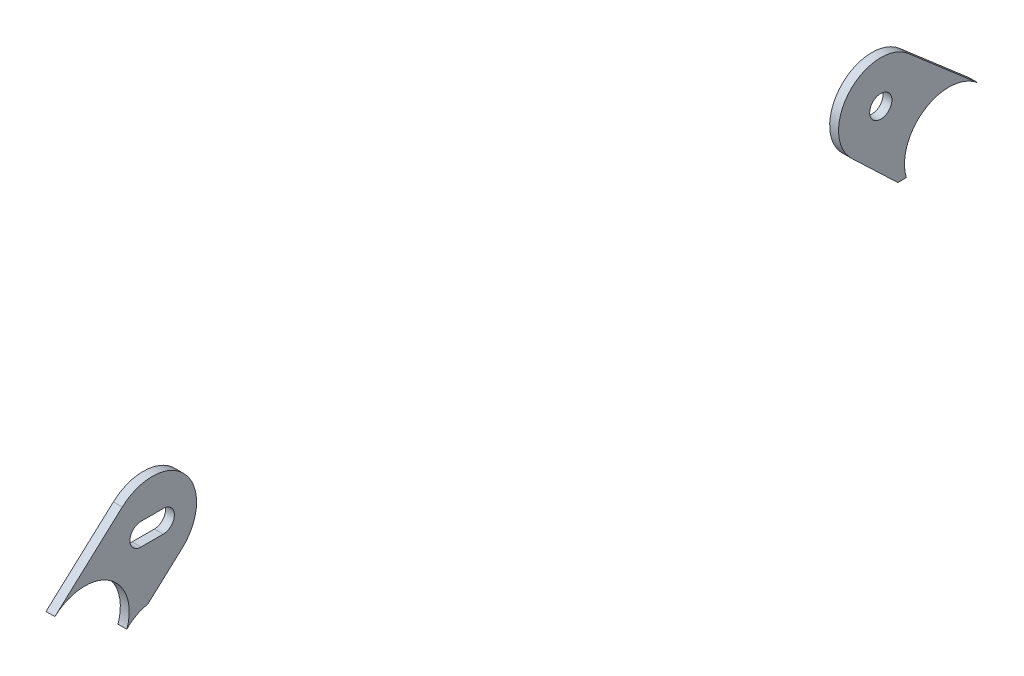
ISO-10303-21;
HEADER;
FILE_DESCRIPTION(('STEP AP214'),'2;1');
FILE_NAME('part.step','',(''),(''),'','','');
FILE_SCHEMA(('AUTOMOTIVE_DESIGN { 1 0 10303 214 1 1 1 1 }'));
ENDSEC;
DATA;
#1=APPLICATION_CONTEXT('core data for automotive mechanical design processes');
#2=APPLICATION_PROTOCOL_DEFINITION('international standard','automotive_design',2000,#1);
#3=PRODUCT_CONTEXT('',#1,'mechanical');
#4=PRODUCT('Part','Part','',(#3));
#5=PRODUCT_RELATED_PRODUCT_CATEGORY('part','',(#4));
#6=PRODUCT_DEFINITION_FORMATION('','',#4);
#7=PRODUCT_DEFINITION_CONTEXT('part definition',#1,'design');
#8=PRODUCT_DEFINITION('design','',#6,#7);
#9=PRODUCT_DEFINITION_SHAPE('','',#8);
#10=(LENGTH_UNIT() NAMED_UNIT(*) SI_UNIT(.MILLI.,.METRE.));
#11=(NAMED_UNIT(*) PLANE_ANGLE_UNIT() SI_UNIT($,.RADIAN.));
#12=(NAMED_UNIT(*) SI_UNIT($,.STERADIAN.) SOLID_ANGLE_UNIT());
#13=UNCERTAINTY_MEASURE_WITH_UNIT(LENGTH_MEASURE(1.E-05),#10,'distance_accuracy_value','');
#14=(GEOMETRIC_REPRESENTATION_CONTEXT(3) GLOBAL_UNCERTAINTY_ASSIGNED_CONTEXT((#13)) GLOBAL_UNIT_ASSIGNED_CONTEXT((#10,
#11,#12)) REPRESENTATION_CONTEXT('',''));
#15=CARTESIAN_POINT('',(0.,0.,0.));
#16=DIRECTION('',(0.,0.,1.));
#17=DIRECTION('',(1.,0.,0.));
#18=AXIS2_PLACEMENT_3D('',#15,#16,#17);
#19=CARTESIAN_POINT('',(2.54,-93.9799999999999,123.630681896452));
#20=DIRECTION('',(-1.,0.,0.));
#21=DIRECTION('',(0.,0.,1.));
#22=AXIS2_PLACEMENT_3D('',#19,#20,#21);
#23=CYLINDRICAL_SURFACE('',#22,12.7);
#24=CARTESIAN_POINT('',(0.,-93.9799999999999,123.630681896452));
#25=DIRECTION('',(1.,0.,0.));
#26=DIRECTION('',(0.,0.,-1.));
#27=AXIS2_PLACEMENT_3D('',#24,#25,#26);
#28=CIRCLE('',#27,12.7);
#29=CARTESIAN_POINT('',(0.,-84.5823964881829,132.173225325354));
#30=VERTEX_POINT('',#29);
#31=CARTESIAN_POINT('',(0.,-98.0167476121944,111.589308689236));
#32=VERTEX_POINT('',#31);
#33=EDGE_CURVE('E125',#30,#32,#28,.F.);
#34=ORIENTED_EDGE('',*,*,#33,.T.);
#35=DIRECTION('',(1.,0.,0.));
#36=VECTOR('',#35,1.);
#37=CARTESIAN_POINT('',(-7.46,-98.0167476122088,111.589308689244));
#38=LINE('',#37,#36);
#39=CARTESIAN_POINT('',(2.54,-98.0167476122088,111.589308689244));
#40=VERTEX_POINT('',#39);
#41=EDGE_CURVE('E114',#32,#40,#38,.T.);
#42=ORIENTED_EDGE('',*,*,#41,.T.);
#43=CARTESIAN_POINT('',(2.54,-93.9799999999999,123.630681896452));
#44=DIRECTION('',(1.,0.,0.));
#45=DIRECTION('',(0.,0.,-1.));
#46=AXIS2_PLACEMENT_3D('',#43,#44,#45);
#47=CIRCLE('',#46,12.7);
#48=CARTESIAN_POINT('',(2.54,-84.5823964881829,132.173225325354));
#49=VERTEX_POINT('',#48);
#50=EDGE_CURVE('E122',#49,#40,#47,.F.);
#51=ORIENTED_EDGE('',*,*,#50,.F.);
#52=DIRECTION('',(-1.,0.,0.));
#53=VECTOR('',#52,1.);
#54=CARTESIAN_POINT('',(2.54,-84.5823964881829,132.173225325354));
#55=LINE('',#54,#53);
#56=EDGE_CURVE('E126',#49,#30,#55,.T.);
#57=ORIENTED_EDGE('',*,*,#56,.T.);
#58=EDGE_LOOP('',(#34,#42,#51,#57));
#59=FACE_BOUND('',#58,.T.);
#60=ADVANCED_FACE('F47',(#59),#23,.F.);
#61=CARTESIAN_POINT('',(2.54,19.4736296992855,17.7017818654862));
#62=DIRECTION('',(0.,0.739968780458032,0.67264121487421));
#63=DIRECTION('',(0.,-0.67264121487421,0.739968780458032));
#64=AXIS2_PLACEMENT_3D('',#61,#62,#63);
#65=PLANE('',#64);
#66=DIRECTION('',(0.,0.67264121487421,-0.739968780458032));
#67=VECTOR('',#66,1.);
#68=CARTESIAN_POINT('',(0.,19.4736296992855,17.7017818654862));
#69=LINE('',#68,#67);
#70=CARTESIAN_POINT('',(0.,-67.0800312151845,112.918972686949));
#71=VERTEX_POINT('',#70);
#72=EDGE_CURVE('E59',#30,#71,#69,.T.);
#73=ORIENTED_EDGE('',*,*,#72,.F.);
#74=ORIENTED_EDGE('',*,*,#56,.F.);
#75=DIRECTION('',(0.,0.67264121487421,-0.739968780458032));
#76=VECTOR('',#75,1.);
#77=CARTESIAN_POINT('',(2.54,19.4736296992855,17.7017818654862));
#78=LINE('',#77,#76);
#79=CARTESIAN_POINT('',(2.54,-67.0800312151845,112.918972686949));
#80=VERTEX_POINT('',#79);
#81=EDGE_CURVE('E131',#49,#80,#78,.T.);
#82=ORIENTED_EDGE('',*,*,#81,.T.);
#83=DIRECTION('',(-1.,0.,0.));
#84=VECTOR('',#83,1.);
#85=CARTESIAN_POINT('',(2.54,-67.0800312151845,112.918972686949));
#86=LINE('',#85,#84);
#87=EDGE_CURVE('E157',#80,#71,#86,.T.);
#88=ORIENTED_EDGE('',*,*,#87,.T.);
#89=EDGE_LOOP('',(#73,#74,#82,#88));
#90=FACE_BOUND('',#89,.T.);
#91=ADVANCED_FACE('F226',(#90),#65,.T.);
#92=CARTESIAN_POINT('',(2.54,0.678422675651489,0.616695007681221));
#93=DIRECTION('',(0.,0.739968780458032,0.67264121487421));
#94=DIRECTION('',(0.,-0.67264121487421,0.739968780458032));
#95=AXIS2_PLACEMENT_3D('',#92,#93,#94);
#96=PLANE('',#95);
#97=DIRECTION('',(0.,0.67264121487421,-0.739968780458032));
#98=VECTOR('',#97,1.);
#99=CARTESIAN_POINT('',(2.54,0.678422675651489,0.616695007681221));
#100=LINE('',#99,#98);
#101=CARTESIAN_POINT('',(2.54,-94.7133216930874,105.556611244448));
#102=VERTEX_POINT('',#101);
#103=CARTESIAN_POINT('',(2.54,-85.8752382388186,95.8338858291443));
#104=VERTEX_POINT('',#103);
#105=EDGE_CURVE('E137',#102,#104,#100,.T.);
#106=ORIENTED_EDGE('',*,*,#105,.F.);
#107=DIRECTION('',(1.,0.,0.));
#108=VECTOR('',#107,1.);
#109=CARTESIAN_POINT('',(-7.46,-94.7133216930888,105.556611244455));
#110=LINE('',#109,#108);
#111=CARTESIAN_POINT('',(0.,-94.7133216930887,105.556611244454));
#112=VERTEX_POINT('',#111);
#113=EDGE_CURVE('E65',#102,#112,#110,.F.);
#114=ORIENTED_EDGE('',*,*,#113,.T.);
#115=DIRECTION('',(0.,0.67264121487421,-0.739968780458032));
#116=VECTOR('',#115,1.);
#117=CARTESIAN_POINT('',(0.,0.678422675651489,0.616695007681221));
#118=LINE('',#117,#116);
#119=CARTESIAN_POINT('',(0.,-85.8752382388186,95.8338858291443));
#120=VERTEX_POINT('',#119);
#121=EDGE_CURVE('E142',#112,#120,#118,.T.);
#122=ORIENTED_EDGE('',*,*,#121,.T.);
#123=DIRECTION('',(-1.,0.,0.));
#124=VECTOR('',#123,1.);
#125=CARTESIAN_POINT('',(2.54,-85.8752382388186,95.8338858291443));
#126=LINE('',#125,#124);
#127=EDGE_CURVE('E216',#104,#120,#126,.T.);
#128=ORIENTED_EDGE('',*,*,#127,.F.);
#129=EDGE_LOOP('',(#106,#114,#122,#128));
#130=FACE_BOUND('',#129,.T.);
#131=ADVANCED_FACE('F228',(#130),#96,.F.);
#132=CARTESIAN_POINT('',(2.54,-76.4776347270015,107.551429258047));
#133=DIRECTION('',(-1.,0.,0.));
#134=DIRECTION('',(0.,0.,1.));
#135=AXIS2_PLACEMENT_3D('',#132,#133,#134);
#136=CYLINDRICAL_SURFACE('',#135,3.175);
#137=CARTESIAN_POINT('',(0.,-76.4776347270015,107.551429258047));
#138=DIRECTION('',(1.,0.,0.));
#139=DIRECTION('',(0.,0.,-1.));
#140=AXIS2_PLACEMENT_3D('',#137,#138,#139);
#141=CIRCLE('',#140,3.175);
#142=CARTESIAN_POINT('',(0.,-73.3026347270015,107.551429258047));
#143=VERTEX_POINT('',#142);
#144=CARTESIAN_POINT('',(0.,-79.6526347270015,107.551429258047));
#145=VERTEX_POINT('',#144);
#146=EDGE_CURVE('E171',#143,#145,#141,.T.);
#147=ORIENTED_EDGE('',*,*,#146,.F.);
#148=DIRECTION('',(-1.,0.,0.));
#149=VECTOR('',#148,1.);
#150=CARTESIAN_POINT('',(2.54,-73.3026347270015,107.551429258047));
#151=LINE('',#150,#149);
#152=CARTESIAN_POINT('',(2.54,-73.3026347270015,107.551429258047));
#153=VERTEX_POINT('',#152);
#154=EDGE_CURVE('E184',#153,#143,#151,.T.);
#155=ORIENTED_EDGE('',*,*,#154,.F.);
#156=CARTESIAN_POINT('',(2.54,-76.4776347270015,107.551429258047));
#157=DIRECTION('',(1.,0.,0.));
#158=DIRECTION('',(0.,0.,-1.));
#159=AXIS2_PLACEMENT_3D('',#156,#157,#158);
#160=CIRCLE('',#159,3.175);
#161=CARTESIAN_POINT('',(2.54,-79.6526347270015,107.551429258047));
#162=VERTEX_POINT('',#161);
#163=EDGE_CURVE('E144',#153,#162,#160,.T.);
#164=ORIENTED_EDGE('',*,*,#163,.T.);
#165=DIRECTION('',(-1.,0.,0.));
#166=VECTOR('',#165,1.);
#167=CARTESIAN_POINT('',(2.54,-79.6526347270015,107.551429258047));
#168=LINE('',#167,#166);
#169=EDGE_CURVE('E155',#162,#145,#168,.T.);
#170=ORIENTED_EDGE('',*,*,#169,.T.);
#171=EDGE_LOOP('',(#147,#155,#164,#170));
#172=FACE_BOUND('',#171,.T.);
#173=ADVANCED_FACE('F208',(#172),#136,.F.);
#174=CARTESIAN_POINT('',(2.54,-73.3026347270015,0.));
#175=DIRECTION('',(0.,1.,0.));
#176=DIRECTION('',(0.,0.,1.));
#177=AXIS2_PLACEMENT_3D('',#174,#175,#176);
#178=PLANE('',#177);
#179=DIRECTION('',(0.,0.,-1.));
#180=VECTOR('',#179,1.);
#181=CARTESIAN_POINT('',(0.,-73.3026347270015,0.));
#182=LINE('',#181,#180);
#183=CARTESIAN_POINT('',(0.,-73.3026347270015,101.201429258047));
#184=VERTEX_POINT('',#183);
#185=EDGE_CURVE('E185',#143,#184,#182,.T.);
#186=ORIENTED_EDGE('',*,*,#185,.T.);
#187=DIRECTION('',(-1.,0.,0.));
#188=VECTOR('',#187,1.);
#189=CARTESIAN_POINT('',(2.54,-73.3026347270015,101.201429258047));
#190=LINE('',#189,#188);
#191=CARTESIAN_POINT('',(2.54,-73.3026347270015,101.201429258047));
#192=VERTEX_POINT('',#191);
#193=EDGE_CURVE('E183',#192,#184,#190,.T.);
#194=ORIENTED_EDGE('',*,*,#193,.F.);
#195=DIRECTION('',(0.,0.,-1.));
#196=VECTOR('',#195,1.);
#197=CARTESIAN_POINT('',(2.54,-73.3026347270015,0.));
#198=LINE('',#197,#196);
#199=EDGE_CURVE('E132',#153,#192,#198,.T.);
#200=ORIENTED_EDGE('',*,*,#199,.F.);
#201=ORIENTED_EDGE('',*,*,#154,.T.);
#202=EDGE_LOOP('',(#186,#194,#200,#201));
#203=FACE_BOUND('',#202,.T.);
#204=ADVANCED_FACE('F212',(#203),#178,.F.);
#205=CARTESIAN_POINT('',(2.54,-76.4776347270015,101.201429258047));
#206=DIRECTION('',(-1.,0.,0.));
#207=DIRECTION('',(0.,0.,1.));
#208=AXIS2_PLACEMENT_3D('',#205,#206,#207);
#209=CYLINDRICAL_SURFACE('',#208,3.175);
#210=CARTESIAN_POINT('',(0.,-76.4776347270015,101.201429258047));
#211=DIRECTION('',(1.,0.,0.));
#212=DIRECTION('',(0.,0.,-1.));
#213=AXIS2_PLACEMENT_3D('',#210,#211,#212);
#214=CIRCLE('',#213,3.175);
#215=CARTESIAN_POINT('',(0.,-79.6526347270015,101.201429258047));
#216=VERTEX_POINT('',#215);
#217=EDGE_CURVE('E180',#184,#216,#214,.F.);
#218=ORIENTED_EDGE('',*,*,#217,.T.);
#219=DIRECTION('',(-1.,0.,0.));
#220=VECTOR('',#219,1.);
#221=CARTESIAN_POINT('',(2.54,-79.6526347270015,101.201429258047));
#222=LINE('',#221,#220);
#223=CARTESIAN_POINT('',(2.54,-79.6526347270015,101.201429258047));
#224=VERTEX_POINT('',#223);
#225=EDGE_CURVE('E191',#224,#216,#222,.T.);
#226=ORIENTED_EDGE('',*,*,#225,.F.);
#227=CARTESIAN_POINT('',(2.54,-76.4776347270015,101.201429258047));
#228=DIRECTION('',(1.,0.,0.));
#229=DIRECTION('',(0.,0.,-1.));
#230=AXIS2_PLACEMENT_3D('',#227,#228,#229);
#231=CIRCLE('',#230,3.175);
#232=EDGE_CURVE('E135',#192,#224,#231,.F.);
#233=ORIENTED_EDGE('',*,*,#232,.F.);
#234=ORIENTED_EDGE('',*,*,#193,.T.);
#235=EDGE_LOOP('',(#218,#226,#233,#234));
#236=FACE_BOUND('',#235,.T.);
#237=ADVANCED_FACE('F200',(#236),#209,.F.);
#238=CARTESIAN_POINT('',(2.54,-79.6526347270015,0.));
#239=DIRECTION('',(0.,1.,0.));
#240=DIRECTION('',(0.,0.,1.));
#241=AXIS2_PLACEMENT_3D('',#238,#239,#240);
#242=PLANE('',#241);
#243=DIRECTION('',(0.,0.,-1.));
#244=VECTOR('',#243,1.);
#245=CARTESIAN_POINT('',(0.,-79.6526347270015,0.));
#246=LINE('',#245,#244);
#247=EDGE_CURVE('E163',#145,#216,#246,.T.);
#248=ORIENTED_EDGE('',*,*,#247,.F.);
#249=ORIENTED_EDGE('',*,*,#169,.F.);
#250=DIRECTION('',(0.,0.,-1.));
#251=VECTOR('',#250,1.);
#252=CARTESIAN_POINT('',(2.54,-79.6526347270015,0.));
#253=LINE('',#252,#251);
#254=EDGE_CURVE('E188',#162,#224,#253,.T.);
#255=ORIENTED_EDGE('',*,*,#254,.T.);
#256=ORIENTED_EDGE('',*,*,#225,.T.);
#257=EDGE_LOOP('',(#248,#249,#255,#256));
#258=FACE_BOUND('',#257,.T.);
#259=ADVANCED_FACE('F204',(#258),#242,.T.);
#260=CARTESIAN_POINT('',(2.54,-76.4776347270015,104.376429258047));
#261=DIRECTION('',(-1.,0.,0.));
#262=DIRECTION('',(0.,0.,1.));
#263=AXIS2_PLACEMENT_3D('',#260,#261,#262);
#264=CYLINDRICAL_SURFACE('',#263,12.7);
#265=CARTESIAN_POINT('',(0.,-76.4776347270015,104.376429258047));
#266=DIRECTION('',(1.,0.,0.));
#267=DIRECTION('',(0.,0.,-1.));
#268=AXIS2_PLACEMENT_3D('',#265,#266,#267);
#269=CIRCLE('',#268,12.7);
#270=EDGE_CURVE('E202',#120,#71,#269,.T.);
#271=ORIENTED_EDGE('',*,*,#270,.T.);
#272=ORIENTED_EDGE('',*,*,#87,.F.);
#273=CARTESIAN_POINT('',(2.54,-76.4776347270015,104.376429258047));
#274=DIRECTION('',(1.,0.,0.));
#275=DIRECTION('',(0.,0.,-1.));
#276=AXIS2_PLACEMENT_3D('',#273,#274,#275);
#277=CIRCLE('',#276,12.7);
#278=EDGE_CURVE('E133',#104,#80,#277,.T.);
#279=ORIENTED_EDGE('',*,*,#278,.F.);
#280=ORIENTED_EDGE('',*,*,#127,.T.);
#281=EDGE_LOOP('',(#271,#272,#279,#280));
#282=FACE_BOUND('',#281,.T.);
#283=ADVANCED_FACE('F221',(#282),#264,.T.);
#284=CARTESIAN_POINT('',(2.54,0.,0.));
#285=DIRECTION('',(1.,0.,0.));
#286=DIRECTION('',(0.,0.,-1.));
#287=AXIS2_PLACEMENT_3D('',#284,#285,#286);
#288=PLANE('',#287);
#289=CARTESIAN_POINT('',(2.54,-101.509044233429,113.403096994286));
#290=CARTESIAN_POINT('',(2.54,-123.190312644533,118.635496441264));
#291=CARTESIAN_POINT('',(2.54,-137.545998525153,87.3000456509904));
#292=CARTESIAN_POINT('',(2.54,-118.095600297756,77.1981245773637));
#293=CARTESIAN_POINT('',(2.54,-98.6452020703594,67.096203503737));
#294=CARTESIAN_POINT('',(2.54,-81.2669289147345,96.8618181532147));
#295=CARTESIAN_POINT('',(2.54,-98.0167476122088,111.589308689244));
#296=(BOUNDED_CURVE() B_SPLINE_CURVE(3,(#289,#290,#291,#292,#293,#294,#295),.UNSPECIFIED.,.F.,
.F.) B_SPLINE_CURVE_WITH_KNOTS((4,3,4),(0.,0.5,1.),
.UNSPECIFIED.) CURVE() GEOMETRIC_REPRESENTATION_ITEM() RATIONAL_B_SPLINE_CURVE((1.,
0.385133254336965,0.385133254336965,1.,0.385133254336965,0.385133254336965,1.)) REPRESENTATION_ITEM(''));
#297=EDGE_CURVE('E12',#102,#40,#296,.T.);
#298=ORIENTED_EDGE('',*,*,#297,.F.);
#299=ORIENTED_EDGE('',*,*,#105,.T.);
#300=ORIENTED_EDGE('',*,*,#278,.T.);
#301=ORIENTED_EDGE('',*,*,#81,.F.);
#302=ORIENTED_EDGE('',*,*,#50,.T.);
#303=EDGE_LOOP('',(#298,#299,#300,#301,#302));
#304=FACE_BOUND('',#303,.T.);
#305=ORIENTED_EDGE('',*,*,#163,.F.);
#306=ORIENTED_EDGE('',*,*,#199,.T.);
#307=ORIENTED_EDGE('',*,*,#232,.T.);
#308=ORIENTED_EDGE('',*,*,#254,.F.);
#309=EDGE_LOOP('',(#305,#306,#307,#308));
#310=FACE_BOUND('',#309,.T.);
#311=ADVANCED_FACE('F128',(#304,#310),#288,.T.);
#312=CARTESIAN_POINT('',(0.,0.,0.));
#313=DIRECTION('',(1.,0.,0.));
#314=DIRECTION('',(0.,0.,-1.));
#315=AXIS2_PLACEMENT_3D('',#312,#313,#314);
#316=PLANE('',#315);
#317=ORIENTED_EDGE('',*,*,#146,.T.);
#318=ORIENTED_EDGE('',*,*,#247,.T.);
#319=ORIENTED_EDGE('',*,*,#217,.F.);
#320=ORIENTED_EDGE('',*,*,#185,.F.);
#321=EDGE_LOOP('',(#317,#318,#319,#320));
#322=FACE_BOUND('',#321,.T.);
#323=ORIENTED_EDGE('',*,*,#121,.F.);
#324=CARTESIAN_POINT('',(0.,-101.509044233429,113.403096994286));
#325=CARTESIAN_POINT('',(0.,-123.190312644533,118.635496441264));
#326=CARTESIAN_POINT('',(0.,-137.545998525153,87.3000456509904));
#327=CARTESIAN_POINT('',(0.,-118.095600297756,77.1981245773637));
#328=CARTESIAN_POINT('',(0.,-98.6452020703594,67.096203503737));
#329=CARTESIAN_POINT('',(0.,-81.2669289147345,96.8618181532147));
#330=CARTESIAN_POINT('',(0.,-98.0167476122088,111.589308689244));
#331=(BOUNDED_CURVE() B_SPLINE_CURVE(3,(#324,#325,#326,#327,#328,#329,#330),.UNSPECIFIED.,.F.,
.F.) B_SPLINE_CURVE_WITH_KNOTS((4,3,4),(0.,0.5,1.),
.UNSPECIFIED.) CURVE() GEOMETRIC_REPRESENTATION_ITEM() RATIONAL_B_SPLINE_CURVE((1.,
0.385133254336965,0.385133254336965,1.,0.385133254336965,0.385133254336965,1.)) REPRESENTATION_ITEM(''));
#332=EDGE_CURVE('E160',#112,#32,#331,.T.);
#333=ORIENTED_EDGE('',*,*,#332,.T.);
#334=ORIENTED_EDGE('',*,*,#33,.F.);
#335=ORIENTED_EDGE('',*,*,#72,.T.);
#336=ORIENTED_EDGE('',*,*,#270,.F.);
#337=EDGE_LOOP('',(#323,#333,#334,#335,#336));
#338=FACE_BOUND('',#337,.T.);
#339=ADVANCED_FACE('F224',(#322,#338),#316,.F.);
#340=CARTESIAN_POINT('',(-7.46,-101.509044233429,113.403096994286));
#341=CARTESIAN_POINT('',(-7.46,-123.190312644533,118.635496441264));
#342=CARTESIAN_POINT('',(-7.46,-137.545998525153,87.3000456509904));
#343=CARTESIAN_POINT('',(-7.46,-118.095600297756,77.1981245773637));
#344=CARTESIAN_POINT('',(-7.46,-98.6452020703594,67.096203503737));
#345=CARTESIAN_POINT('',(-7.46,-81.2669289147345,96.8618181532147));
#346=CARTESIAN_POINT('',(-7.46,-98.0167476122088,111.589308689244));
#347=(BOUNDED_CURVE() B_SPLINE_CURVE(3,(#340,#341,#342,#343,#344,#345,#346),.UNSPECIFIED.,.F.,
.F.) B_SPLINE_CURVE_WITH_KNOTS((4,3,4),(0.,0.5,1.),
.UNSPECIFIED.) CURVE() GEOMETRIC_REPRESENTATION_ITEM() RATIONAL_B_SPLINE_CURVE((1.,
0.385133254336965,0.385133254336965,1.,0.385133254336965,0.385133254336965,1.)) REPRESENTATION_ITEM(''));
#348=DIRECTION('',(1.,0.,0.));
#349=VECTOR('',#348,1.);
#350=SURFACE_OF_LINEAR_EXTRUSION('',#347,#349);
#351=ORIENTED_EDGE('',*,*,#297,.T.);
#352=ORIENTED_EDGE('',*,*,#41,.F.);
#353=ORIENTED_EDGE('',*,*,#332,.F.);
#354=ORIENTED_EDGE('',*,*,#113,.F.);
#355=EDGE_LOOP('',(#351,#352,#353,#354));
#356=FACE_BOUND('',#355,.T.);
#357=ADVANCED_FACE('F49',(#356),#350,.F.);
#358=CLOSED_SHELL('',(#60,#91,#131,#173,#204,#237,#259,#283,#311,#339,#357));
#359=MANIFOLD_SOLID_BREP('B2',#358);
#360=CARTESIAN_POINT('',(2.54,3.13589897690466,-2.98741917325872));
#361=DIRECTION('',(0.,0.724040060910686,-0.689757921445234));
#362=DIRECTION('',(0.,0.689757921445234,0.724040060910686));
#363=AXIS2_PLACEMENT_3D('',#360,#361,#362);
#364=PLANE('',#363);
#365=DIRECTION('',(0.,-0.689757921445234,-0.724040060910686));
#366=VECTOR('',#365,1.);
#367=CARTESIAN_POINT('',(0.,3.13589897690466,-2.98741917325872));
#368=LINE('',#367,#366);
#369=CARTESIAN_POINT('',(0.,-85.0345359441756,-95.5400743671568));
#370=VERTEX_POINT('',#369);
#371=CARTESIAN_POINT('',(0.,-97.5957432267359,-108.72559497259));
#372=VERTEX_POINT('',#371);
#373=EDGE_CURVE('E401',#370,#372,#368,.T.);
#374=ORIENTED_EDGE('',*,*,#373,.T.);
#375=DIRECTION('',(1.,0.,0.));
#376=VECTOR('',#375,1.);
#377=CARTESIAN_POINT('',(2.54,-97.5957432267359,-108.72559497259));
#378=LINE('',#377,#376);
#379=CARTESIAN_POINT('',(2.54,-97.5957432267359,-108.72559497259));
#380=VERTEX_POINT('',#379);
#381=EDGE_CURVE('E335',#372,#380,#378,.T.);
#382=ORIENTED_EDGE('',*,*,#381,.T.);
#383=DIRECTION('',(0.,-0.689757921445234,-0.724040060910686));
#384=VECTOR('',#383,1.);
#385=CARTESIAN_POINT('',(2.54,3.13589897690466,-2.98741917325872));
#386=LINE('',#385,#384);
#387=CARTESIAN_POINT('',(2.54,-85.0345359441756,-95.5400743671568));
#388=VERTEX_POINT('',#387);
#389=EDGE_CURVE('E384',#388,#380,#386,.T.);
#390=ORIENTED_EDGE('',*,*,#389,.F.);
#391=DIRECTION('',(-1.,0.,0.));
#392=VECTOR('',#391,1.);
#393=CARTESIAN_POINT('',(2.54,-85.0345359441756,-95.5400743671568));
#394=LINE('',#393,#392);
#395=EDGE_CURVE('E343',#388,#370,#394,.T.);
#396=ORIENTED_EDGE('',*,*,#395,.T.);
#397=EDGE_LOOP('',(#374,#382,#390,#396));
#398=FACE_BOUND('',#397,.T.);
#399=ADVANCED_FACE('F320',(#398),#364,.F.);
#400=CARTESIAN_POINT('',(2.54,-93.98,-123.3424));
#401=DIRECTION('',(-1.,0.,0.));
#402=DIRECTION('',(0.,0.,1.));
#403=AXIS2_PLACEMENT_3D('',#400,#401,#402);
#404=CYLINDRICAL_SURFACE('',#403,12.7);
#405=CARTESIAN_POINT('',(2.54,-93.98,-123.3424));
#406=DIRECTION('',(1.,0.,0.));
#407=DIRECTION('',(0.,0.,-1.));
#408=AXIS2_PLACEMENT_3D('',#405,#406,#407);
#409=CIRCLE('',#408,12.7);
#410=CARTESIAN_POINT('',(2.54,-97.5957432267359,-111.167984165213));
#411=VERTEX_POINT('',#410);
#412=CARTESIAN_POINT('',(2.54,-84.3726476249668,-131.648348491409));
#413=VERTEX_POINT('',#412);
#414=EDGE_CURVE('E365',#411,#413,#409,.F.);
#415=ORIENTED_EDGE('',*,*,#414,.F.);
#416=DIRECTION('',(-1.,0.,0.));
#417=VECTOR('',#416,1.);
#418=CARTESIAN_POINT('',(2.54,-97.5957432267359,-111.167984165213));
#419=LINE('',#418,#417);
#420=CARTESIAN_POINT('',(0.,-97.5957432267359,-111.167984165213));
#421=VERTEX_POINT('',#420);
#422=EDGE_CURVE('E374',#411,#421,#419,.T.);
#423=ORIENTED_EDGE('',*,*,#422,.T.);
#424=CARTESIAN_POINT('',(0.,-93.98,-123.3424));
#425=DIRECTION('',(1.,0.,0.));
#426=DIRECTION('',(0.,0.,-1.));
#427=AXIS2_PLACEMENT_3D('',#424,#425,#426);
#428=CIRCLE('',#427,12.7);
#429=CARTESIAN_POINT('',(0.,-84.3726476249668,-131.648348491409));
#430=VERTEX_POINT('',#429);
#431=EDGE_CURVE('E403',#421,#430,#428,.F.);
#432=ORIENTED_EDGE('',*,*,#431,.T.);
#433=DIRECTION('',(-1.,0.,0.));
#434=VECTOR('',#433,1.);
#435=CARTESIAN_POINT('',(2.54,-84.3726476249668,-131.648348491409));
#436=LINE('',#435,#434);
#437=EDGE_CURVE('E328',#413,#430,#436,.T.);
#438=ORIENTED_EDGE('',*,*,#437,.F.);
#439=EDGE_LOOP('',(#415,#423,#432,#438));
#440=FACE_BOUND('',#439,.T.);
#441=ADVANCED_FACE('F386',(#440),#404,.F.);
#442=CARTESIAN_POINT('',(2.54,16.8491508070536,-14.5667789901262));
#443=DIRECTION('',(0.,0.756484438978995,-0.654011692236947));
#444=DIRECTION('',(0.,0.654011692236947,0.756484438978995));
#445=AXIS2_PLACEMENT_3D('',#442,#443,#444);
#446=PLANE('',#445);
#447=DIRECTION('',(0.,-0.654011692236947,-0.756484438978995));
#448=VECTOR('',#447,1.);
#449=CARTESIAN_POINT('',(0.,16.8491508070536,-14.5667789901262));
#450=LINE('',#449,#448);
#451=CARTESIAN_POINT('',(0.,-67.1720078530066,-111.752654756232));
#452=VERTEX_POINT('',#451);
#453=EDGE_CURVE('E405',#452,#430,#450,.T.);
#454=ORIENTED_EDGE('',*,*,#453,.F.);
#455=DIRECTION('',(-1.,0.,0.));
#456=VECTOR('',#455,1.);
#457=CARTESIAN_POINT('',(2.54,-67.1720078530066,-111.752654756232));
#458=LINE('',#457,#456);
#459=CARTESIAN_POINT('',(2.54,-67.1720078530066,-111.752654756232));
#460=VERTEX_POINT('',#459);
#461=EDGE_CURVE('E412',#460,#452,#458,.T.);
#462=ORIENTED_EDGE('',*,*,#461,.F.);
#463=DIRECTION('',(0.,-0.654011692236947,-0.756484438978995));
#464=VECTOR('',#463,1.);
#465=CARTESIAN_POINT('',(2.54,16.8491508070536,-14.5667789901262));
#466=LINE('',#465,#464);
#467=EDGE_CURVE('E389',#460,#413,#466,.T.);
#468=ORIENTED_EDGE('',*,*,#467,.T.);
#469=ORIENTED_EDGE('',*,*,#437,.T.);
#470=EDGE_LOOP('',(#454,#462,#468,#469));
#471=FACE_BOUND('',#470,.T.);
#472=ADVANCED_FACE('F415',(#471),#446,.T.);
#473=CARTESIAN_POINT('',(2.54,-76.2989926092882,-103.862003689394));
#474=DIRECTION('',(-1.,0.,0.));
#475=DIRECTION('',(0.,0.,1.));
#476=AXIS2_PLACEMENT_3D('',#473,#474,#475);
#477=CYLINDRICAL_SURFACE('',#476,3.17499999999991);
#478=CARTESIAN_POINT('',(2.54,-76.2989926092882,-103.862003689394));
#479=DIRECTION('',(1.,0.,0.));
#480=DIRECTION('',(0.,0.,-1.));
#481=AXIS2_PLACEMENT_3D('',#478,#479,#480);
#482=CIRCLE('',#481,3.17499999999991);
#483=CARTESIAN_POINT('',(2.54,-76.2989926092882,-107.037003689393));
#484=VERTEX_POINT('',#483);
#485=EDGE_CURVE('E393',#484,#484,#482,.T.);
#486=ORIENTED_EDGE('',*,*,#485,.T.);
#487=EDGE_LOOP('',(#486));
#488=FACE_BOUND('',#487,.T.);
#489=CARTESIAN_POINT('',(0.,-76.2989926092882,-103.862003689394));
#490=DIRECTION('',(1.,0.,0.));
#491=DIRECTION('',(0.,0.,-1.));
#492=AXIS2_PLACEMENT_3D('',#489,#490,#491);
#493=CIRCLE('',#492,3.17499999999991);
#494=CARTESIAN_POINT('',(0.,-76.2989926092882,-107.037003689393));
#495=VERTEX_POINT('',#494);
#496=EDGE_CURVE('E398',#495,#495,#493,.T.);
#497=ORIENTED_EDGE('',*,*,#496,.F.);
#498=EDGE_LOOP('',(#497));
#499=FACE_BOUND('',#498,.T.);
#500=ADVANCED_FACE('F322',(#488,#499),#477,.F.);
#501=CARTESIAN_POINT('',(2.54,-76.2989926092882,-103.862003689394));
#502=DIRECTION('',(-1.,0.,0.));
#503=DIRECTION('',(0.,0.,1.));
#504=AXIS2_PLACEMENT_3D('',#501,#502,#503);
#505=CYLINDRICAL_SURFACE('',#504,12.065);
#506=CARTESIAN_POINT('',(0.,-76.2989926092882,-103.862003689394));
#507=DIRECTION('',(1.,0.,0.));
#508=DIRECTION('',(0.,0.,-1.));
#509=AXIS2_PLACEMENT_3D('',#506,#507,#508);
#510=CIRCLE('',#509,12.065);
#511=EDGE_CURVE('E408',#370,#452,#510,.F.);
#512=ORIENTED_EDGE('',*,*,#511,.F.);
#513=ORIENTED_EDGE('',*,*,#395,.F.);
#514=CARTESIAN_POINT('',(2.54,-76.2989926092882,-103.862003689394));
#515=DIRECTION('',(1.,0.,0.));
#516=DIRECTION('',(0.,0.,-1.));
#517=AXIS2_PLACEMENT_3D('',#514,#515,#516);
#518=CIRCLE('',#517,12.065);
#519=EDGE_CURVE('E391',#388,#460,#518,.F.);
#520=ORIENTED_EDGE('',*,*,#519,.T.);
#521=ORIENTED_EDGE('',*,*,#461,.T.);
#522=EDGE_LOOP('',(#512,#513,#520,#521));
#523=FACE_BOUND('',#522,.T.);
#524=ADVANCED_FACE('F418',(#523),#505,.T.);
#525=CARTESIAN_POINT('',(2.54,0.,0.));
#526=DIRECTION('',(1.,0.,0.));
#527=DIRECTION('',(0.,0.,-1.));
#528=AXIS2_PLACEMENT_3D('',#525,#526,#527);
#529=PLANE('',#528);
#530=DIRECTION('',(0.,0.,1.));
#531=VECTOR('',#530,1.);
#532=CARTESIAN_POINT('',(2.54,-97.5957432267359,-108.627984165209));
#533=LINE('',#532,#531);
#534=EDGE_CURVE('E376',#411,#380,#533,.T.);
#535=ORIENTED_EDGE('',*,*,#534,.F.);
#536=ORIENTED_EDGE('',*,*,#414,.T.);
#537=ORIENTED_EDGE('',*,*,#467,.F.);
#538=ORIENTED_EDGE('',*,*,#519,.F.);
#539=ORIENTED_EDGE('',*,*,#389,.T.);
#540=EDGE_LOOP('',(#535,#536,#537,#538,#539));
#541=FACE_BOUND('',#540,.T.);
#542=ORIENTED_EDGE('',*,*,#485,.F.);
#543=EDGE_LOOP('',(#542));
#544=FACE_BOUND('',#543,.T.);
#545=ADVANCED_FACE('F381',(#541,#544),#529,.T.);
#546=CARTESIAN_POINT('',(0.,0.,0.));
#547=DIRECTION('',(1.,0.,0.));
#548=DIRECTION('',(0.,0.,-1.));
#549=AXIS2_PLACEMENT_3D('',#546,#547,#548);
#550=PLANE('',#549);
#551=ORIENTED_EDGE('',*,*,#496,.T.);
#552=EDGE_LOOP('',(#551));
#553=FACE_BOUND('',#552,.T.);
#554=ORIENTED_EDGE('',*,*,#431,.F.);
#555=DIRECTION('',(0.,0.,1.));
#556=VECTOR('',#555,1.);
#557=CARTESIAN_POINT('',(0.,-97.5957432267359,0.));
#558=LINE('',#557,#556);
#559=EDGE_CURVE('E45',#421,#372,#558,.T.);
#560=ORIENTED_EDGE('',*,*,#559,.T.);
#561=ORIENTED_EDGE('',*,*,#373,.F.);
#562=ORIENTED_EDGE('',*,*,#511,.T.);
#563=ORIENTED_EDGE('',*,*,#453,.T.);
#564=EDGE_LOOP('',(#554,#560,#561,#562,#563));
#565=FACE_BOUND('',#564,.T.);
#566=ADVANCED_FACE('F417',(#553,#565),#550,.F.);
#567=CARTESIAN_POINT('',(-7.46,-97.5957432267359,-108.627984165209));
#568=DIRECTION('',(0.,1.,0.));
#569=DIRECTION('',(0.,0.,1.));
#570=AXIS2_PLACEMENT_3D('',#567,#568,#569);
#571=PLANE('',#570);
#572=ORIENTED_EDGE('',*,*,#559,.F.);
#573=ORIENTED_EDGE('',*,*,#422,.F.);
#574=ORIENTED_EDGE('',*,*,#534,.T.);
#575=ORIENTED_EDGE('',*,*,#381,.F.);
#576=EDGE_LOOP('',(#572,#573,#574,#575));
#577=FACE_BOUND('',#576,.T.);
#578=ADVANCED_FACE('F375',(#577),#571,.F.);
#579=CLOSED_SHELL('',(#399,#441,#472,#500,#524,#545,#566,#578));
#580=MANIFOLD_SOLID_BREP('B6',#579);
#581=ADVANCED_BREP_SHAPE_REPRESENTATION('',(#18,#359,#580),#14);
#582=SHAPE_DEFINITION_REPRESENTATION(#9,#581);
ENDSEC;
END-ISO-10303-21;
